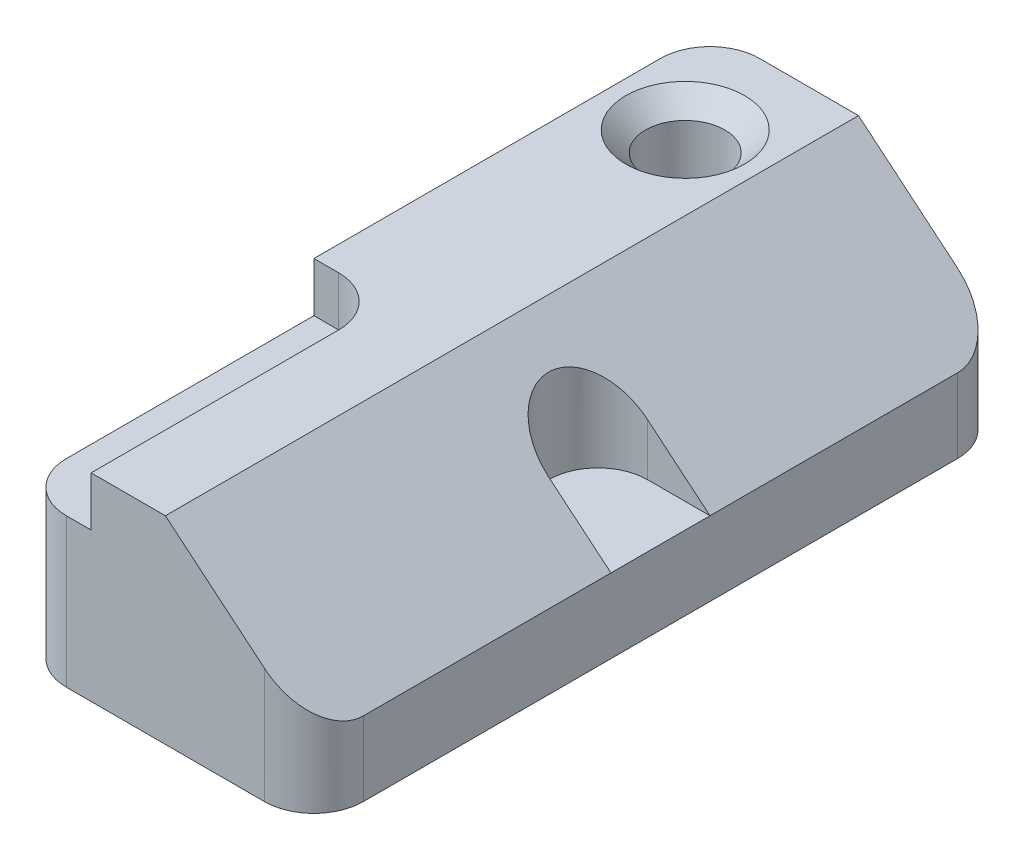
ISO-10303-21;
HEADER;
FILE_DESCRIPTION(('STEP AP214'),'2;1');
FILE_NAME('part.step','',(''),(''),'','','');
FILE_SCHEMA(('AUTOMOTIVE_DESIGN { 1 0 10303 214 1 1 1 1 }'));
ENDSEC;
DATA;
#1=APPLICATION_CONTEXT('core data for automotive mechanical design processes');
#2=APPLICATION_PROTOCOL_DEFINITION('international standard','automotive_design',2000,#1);
#3=PRODUCT_CONTEXT('',#1,'mechanical');
#4=PRODUCT('Part','Part','',(#3));
#5=PRODUCT_RELATED_PRODUCT_CATEGORY('part','',(#4));
#6=PRODUCT_DEFINITION_FORMATION('','',#4);
#7=PRODUCT_DEFINITION_CONTEXT('part definition',#1,'design');
#8=PRODUCT_DEFINITION('design','',#6,#7);
#9=PRODUCT_DEFINITION_SHAPE('','',#8);
#10=(LENGTH_UNIT() NAMED_UNIT(*) SI_UNIT(.MILLI.,.METRE.));
#11=(NAMED_UNIT(*) PLANE_ANGLE_UNIT() SI_UNIT($,.RADIAN.));
#12=(NAMED_UNIT(*) SI_UNIT($,.STERADIAN.) SOLID_ANGLE_UNIT());
#13=UNCERTAINTY_MEASURE_WITH_UNIT(LENGTH_MEASURE(1.E-05),#10,'distance_accuracy_value','');
#14=(GEOMETRIC_REPRESENTATION_CONTEXT(3) GLOBAL_UNCERTAINTY_ASSIGNED_CONTEXT((#13)) GLOBAL_UNIT_ASSIGNED_CONTEXT((#10,
#11,#12)) REPRESENTATION_CONTEXT('',''));
#15=CARTESIAN_POINT('',(0.,0.,0.));
#16=DIRECTION('',(0.,0.,1.));
#17=DIRECTION('',(1.,0.,0.));
#18=AXIS2_PLACEMENT_3D('',#15,#16,#17);
#19=CARTESIAN_POINT('',(0.,0.,177.8));
#20=DIRECTION('',(1.,0.,0.));
#21=DIRECTION('',(0.,0.,-1.));
#22=AXIS2_PLACEMENT_3D('',#19,#20,#21);
#23=PLANE('',#22);
#24=DIRECTION('',(0.,0.,-1.));
#25=VECTOR('',#24,1.);
#26=CARTESIAN_POINT('',(0.,0.,177.8));
#27=LINE('',#26,#25);
#28=CARTESIAN_POINT('',(0.,0.,165.1));
#29=VERTEX_POINT('',#28);
#30=CARTESIAN_POINT('',(0.,0.,12.7));
#31=VERTEX_POINT('',#30);
#32=EDGE_CURVE('E184',#29,#31,#27,.T.);
#33=ORIENTED_EDGE('',*,*,#32,.F.);
#34=DIRECTION('',(0.,-1.,0.));
#35=VECTOR('',#34,1.);
#36=CARTESIAN_POINT('',(0.,0.,165.1));
#37=LINE('',#36,#35);
#38=CARTESIAN_POINT('',(0.,38.1,165.1));
#39=VERTEX_POINT('',#38);
#40=EDGE_CURVE('E219',#29,#39,#37,.F.);
#41=ORIENTED_EDGE('',*,*,#40,.T.);
#42=DIRECTION('',(0.,0.,-1.));
#43=VECTOR('',#42,1.);
#44=CARTESIAN_POINT('',(0.,38.1,177.8));
#45=LINE('',#44,#43);
#46=CARTESIAN_POINT('',(0.,38.1,101.6));
#47=VERTEX_POINT('',#46);
#48=EDGE_CURVE('E300',#39,#47,#45,.T.);
#49=ORIENTED_EDGE('',*,*,#48,.T.);
#50=DIRECTION('',(0.,1.,0.));
#51=VECTOR('',#50,1.);
#52=CARTESIAN_POINT('',(0.,38.1,101.6));
#53=LINE('',#52,#51);
#54=CARTESIAN_POINT('',(0.,50.8,101.6));
#55=VERTEX_POINT('',#54);
#56=EDGE_CURVE('E283',#47,#55,#53,.T.);
#57=ORIENTED_EDGE('',*,*,#56,.T.);
#58=DIRECTION('',(0.,0.,-1.));
#59=VECTOR('',#58,1.);
#60=CARTESIAN_POINT('',(0.,50.8,177.8));
#61=LINE('',#60,#59);
#62=CARTESIAN_POINT('',(0.,50.8,12.7));
#63=VERTEX_POINT('',#62);
#64=EDGE_CURVE('E179',#55,#63,#61,.T.);
#65=ORIENTED_EDGE('',*,*,#64,.T.);
#66=DIRECTION('',(0.,-1.,0.));
#67=VECTOR('',#66,1.);
#68=CARTESIAN_POINT('',(0.,0.,12.7));
#69=LINE('',#68,#67);
#70=EDGE_CURVE('E216',#63,#31,#69,.T.);
#71=ORIENTED_EDGE('',*,*,#70,.T.);
#72=EDGE_LOOP('',(#33,#41,#49,#57,#65,#71));
#73=FACE_BOUND('',#72,.T.);
#74=ADVANCED_FACE('F35',(#73),#23,.F.);
#75=CARTESIAN_POINT('',(0.,50.8,177.8));
#76=DIRECTION('',(0.,-1.,0.));
#77=DIRECTION('',(0.,0.,-1.));
#78=AXIS2_PLACEMENT_3D('',#75,#76,#77);
#79=PLANE('',#78);
#80=CARTESIAN_POINT('',(19.05,50.8,25.4));
#81=DIRECTION('',(0.,-1.,0.));
#82=DIRECTION('',(0.,0.,-1.));
#83=AXIS2_PLACEMENT_3D('',#80,#81,#82);
#84=CIRCLE('',#83,15.24);
#85=CARTESIAN_POINT('',(19.05,50.8,10.16));
#86=VERTEX_POINT('',#85);
#87=EDGE_CURVE('E190',#86,#86,#84,.T.);
#88=ORIENTED_EDGE('',*,*,#87,.T.);
#89=EDGE_LOOP('',(#88));
#90=FACE_BOUND('',#89,.T.);
#91=DIRECTION('',(-1.,0.,0.));
#92=VECTOR('',#91,1.);
#93=CARTESIAN_POINT('',(0.,50.8,0.));
#94=LINE('',#93,#92);
#95=CARTESIAN_POINT('',(38.1,50.8,0.));
#96=VERTEX_POINT('',#95);
#97=CARTESIAN_POINT('',(12.7,50.8,0.));
#98=VERTEX_POINT('',#97);
#99=EDGE_CURVE('E245',#96,#98,#94,.T.);
#100=ORIENTED_EDGE('',*,*,#99,.T.);
#101=CARTESIAN_POINT('',(12.7,50.8,12.7));
#102=DIRECTION('',(0.,-1.,0.));
#103=DIRECTION('',(0.,0.,-1.));
#104=AXIS2_PLACEMENT_3D('',#101,#102,#103);
#105=CIRCLE('',#104,12.7);
#106=EDGE_CURVE('E227',#98,#63,#105,.F.);
#107=ORIENTED_EDGE('',*,*,#106,.T.);
#108=ORIENTED_EDGE('',*,*,#64,.F.);
#109=DIRECTION('',(1.,0.,0.));
#110=VECTOR('',#109,1.);
#111=CARTESIAN_POINT('',(0.,50.8,101.6));
#112=LINE('',#111,#110);
#113=CARTESIAN_POINT('',(6.35,50.8,101.6));
#114=VERTEX_POINT('',#113);
#115=EDGE_CURVE('E306',#55,#114,#112,.T.);
#116=ORIENTED_EDGE('',*,*,#115,.T.);
#117=CARTESIAN_POINT('',(6.35,50.8,114.3));
#118=DIRECTION('',(0.,-1.,0.));
#119=DIRECTION('',(0.,0.,-1.));
#120=AXIS2_PLACEMENT_3D('',#117,#118,#119);
#121=CIRCLE('',#120,12.7);
#122=CARTESIAN_POINT('',(19.05,50.8,114.3));
#123=VERTEX_POINT('',#122);
#124=EDGE_CURVE('E200',#114,#123,#121,.T.);
#125=ORIENTED_EDGE('',*,*,#124,.T.);
#126=DIRECTION('',(0.,0.,-1.));
#127=VECTOR('',#126,1.);
#128=CARTESIAN_POINT('',(19.05,50.8,177.8));
#129=LINE('',#128,#127);
#130=CARTESIAN_POINT('',(19.05,50.8,177.8));
#131=VERTEX_POINT('',#130);
#132=EDGE_CURVE('E303',#131,#123,#129,.T.);
#133=ORIENTED_EDGE('',*,*,#132,.F.);
#134=DIRECTION('',(-1.,0.,0.));
#135=VECTOR('',#134,1.);
#136=CARTESIAN_POINT('',(0.,50.8,177.8));
#137=LINE('',#136,#135);
#138=CARTESIAN_POINT('',(38.1,50.8,177.8));
#139=VERTEX_POINT('',#138);
#140=EDGE_CURVE('E267',#139,#131,#137,.T.);
#141=ORIENTED_EDGE('',*,*,#140,.F.);
#142=DIRECTION('',(0.,0.,-1.));
#143=VECTOR('',#142,1.);
#144=CARTESIAN_POINT('',(38.1,50.8,177.8));
#145=LINE('',#144,#143);
#146=EDGE_CURVE('E175',#139,#96,#145,.T.);
#147=ORIENTED_EDGE('',*,*,#146,.T.);
#148=EDGE_LOOP('',(#100,#107,#108,#116,#125,#133,#141,#147));
#149=FACE_BOUND('',#148,.T.);
#150=ADVANCED_FACE('F290',(#90,#149),#79,.F.);
#151=CARTESIAN_POINT('',(0.,0.,177.8));
#152=DIRECTION('',(0.,1.,0.));
#153=DIRECTION('',(0.,0.,1.));
#154=AXIS2_PLACEMENT_3D('',#151,#152,#153);
#155=PLANE('',#154);
#156=CARTESIAN_POINT('',(19.05,0.,25.4));
#157=DIRECTION('',(0.,1.,0.));
#158=DIRECTION('',(0.,0.,1.));
#159=AXIS2_PLACEMENT_3D('',#156,#157,#158);
#160=CIRCLE('',#159,10.16);
#161=CARTESIAN_POINT('',(19.05,0.,35.56));
#162=VERTEX_POINT('',#161);
#163=EDGE_CURVE('E271',#162,#162,#160,.T.);
#164=ORIENTED_EDGE('',*,*,#163,.T.);
#165=EDGE_LOOP('',(#164));
#166=FACE_BOUND('',#165,.T.);
#167=DIRECTION('',(1.,0.,0.));
#168=VECTOR('',#167,1.);
#169=CARTESIAN_POINT('',(0.,0.,177.8));
#170=LINE('',#169,#168);
#171=CARTESIAN_POINT('',(12.7,0.,177.8));
#172=VERTEX_POINT('',#171);
#173=CARTESIAN_POINT('',(63.5,0.,177.8));
#174=VERTEX_POINT('',#173);
#175=EDGE_CURVE('E259',#172,#174,#170,.T.);
#176=ORIENTED_EDGE('',*,*,#175,.F.);
#177=CARTESIAN_POINT('',(12.7,0.,165.1));
#178=DIRECTION('',(0.,1.,0.));
#179=DIRECTION('',(0.,0.,1.));
#180=AXIS2_PLACEMENT_3D('',#177,#178,#179);
#181=CIRCLE('',#180,12.7);
#182=EDGE_CURVE('E214',#172,#29,#181,.F.);
#183=ORIENTED_EDGE('',*,*,#182,.T.);
#184=ORIENTED_EDGE('',*,*,#32,.T.);
#185=CARTESIAN_POINT('',(12.7,0.,12.7));
#186=DIRECTION('',(0.,1.,0.));
#187=DIRECTION('',(0.,0.,1.));
#188=AXIS2_PLACEMENT_3D('',#185,#186,#187);
#189=CIRCLE('',#188,12.7);
#190=CARTESIAN_POINT('',(12.7,0.,0.));
#191=VERTEX_POINT('',#190);
#192=EDGE_CURVE('E212',#31,#191,#189,.F.);
#193=ORIENTED_EDGE('',*,*,#192,.T.);
#194=DIRECTION('',(1.,0.,0.));
#195=VECTOR('',#194,1.);
#196=CARTESIAN_POINT('',(0.,0.,0.));
#197=LINE('',#196,#195);
#198=CARTESIAN_POINT('',(63.5,0.,0.));
#199=VERTEX_POINT('',#198);
#200=EDGE_CURVE('E246',#191,#199,#197,.T.);
#201=ORIENTED_EDGE('',*,*,#200,.T.);
#202=CARTESIAN_POINT('',(63.5,0.,12.7));
#203=DIRECTION('',(0.,1.,0.));
#204=DIRECTION('',(0.,0.,1.));
#205=AXIS2_PLACEMENT_3D('',#202,#203,#204);
#206=CIRCLE('',#205,12.7);
#207=CARTESIAN_POINT('',(76.2,0.,12.7));
#208=VERTEX_POINT('',#207);
#209=EDGE_CURVE('E210',#199,#208,#206,.F.);
#210=ORIENTED_EDGE('',*,*,#209,.T.);
#211=DIRECTION('',(0.,0.,-1.));
#212=VECTOR('',#211,1.);
#213=CARTESIAN_POINT('',(76.2,0.,177.8));
#214=LINE('',#213,#212);
#215=CARTESIAN_POINT('',(76.2,0.,165.1));
#216=VERTEX_POINT('',#215);
#217=EDGE_CURVE('E177',#216,#208,#214,.T.);
#218=ORIENTED_EDGE('',*,*,#217,.F.);
#219=CARTESIAN_POINT('',(63.5,0.,165.1));
#220=DIRECTION('',(0.,1.,0.));
#221=DIRECTION('',(0.,0.,1.));
#222=AXIS2_PLACEMENT_3D('',#219,#220,#221);
#223=CIRCLE('',#222,12.7);
#224=EDGE_CURVE('E208',#216,#174,#223,.F.);
#225=ORIENTED_EDGE('',*,*,#224,.T.);
#226=EDGE_LOOP('',(#176,#183,#184,#193,#201,#210,#218,#225));
#227=FACE_BOUND('',#226,.T.);
#228=ADVANCED_FACE('F253',(#166,#227),#155,.F.);
#229=CARTESIAN_POINT('',(76.2,0.,177.8));
#230=DIRECTION('',(-1.,0.,0.));
#231=DIRECTION('',(0.,0.,1.));
#232=AXIS2_PLACEMENT_3D('',#229,#230,#231);
#233=PLANE('',#232);
#234=ORIENTED_EDGE('',*,*,#217,.T.);
#235=DIRECTION('',(0.,1.,0.));
#236=VECTOR('',#235,1.);
#237=CARTESIAN_POINT('',(76.2,19.05,12.7));
#238=LINE('',#237,#236);
#239=CARTESIAN_POINT('',(76.2,19.05,12.7));
#240=VERTEX_POINT('',#239);
#241=EDGE_CURVE('E173',#208,#240,#238,.T.);
#242=ORIENTED_EDGE('',*,*,#241,.T.);
#243=DIRECTION('',(0.,0.,-1.));
#244=VECTOR('',#243,1.);
#245=CARTESIAN_POINT('',(76.2,19.05,177.8));
#246=LINE('',#245,#244);
#247=CARTESIAN_POINT('',(76.2,19.05,76.2));
#248=VERTEX_POINT('',#247);
#249=EDGE_CURVE('E58',#248,#240,#246,.T.);
#250=ORIENTED_EDGE('',*,*,#249,.F.);
#251=DIRECTION('',(0.,0.,-1.));
#252=VECTOR('',#251,1.);
#253=CARTESIAN_POINT('',(76.2,19.05,101.6));
#254=LINE('',#253,#252);
#255=CARTESIAN_POINT('',(76.2,19.05,101.6));
#256=VERTEX_POINT('',#255);
#257=EDGE_CURVE('E157',#256,#248,#254,.T.);
#258=ORIENTED_EDGE('',*,*,#257,.F.);
#259=CARTESIAN_POINT('',(76.2,19.05,165.1));
#260=VERTEX_POINT('',#259);
#261=EDGE_CURVE('E174',#260,#256,#246,.T.);
#262=ORIENTED_EDGE('',*,*,#261,.F.);
#263=DIRECTION('',(0.,1.,0.));
#264=VECTOR('',#263,1.);
#265=CARTESIAN_POINT('',(76.2,0.,165.1));
#266=LINE('',#265,#264);
#267=EDGE_CURVE('E229',#260,#216,#266,.F.);
#268=ORIENTED_EDGE('',*,*,#267,.T.);
#269=EDGE_LOOP('',(#234,#242,#250,#258,#262,#268));
#270=FACE_BOUND('',#269,.T.);
#271=ADVANCED_FACE('F171',(#270),#233,.F.);
#272=CARTESIAN_POINT('',(38.1,50.8,177.8));
#273=DIRECTION('',(-0.64018439966448,-0.768221279597376,0.));
#274=DIRECTION('',(0.768221279597376,-0.64018439966448,0.));
#275=AXIS2_PLACEMENT_3D('',#272,#273,#274);
#276=PLANE('',#275);
#277=ORIENTED_EDGE('',*,*,#261,.T.);
#278=DIRECTION('',(-0.768221279597376,0.64018439966448,0.));
#279=VECTOR('',#278,1.);
#280=CARTESIAN_POINT('',(38.1,50.8,101.6));
#281=LINE('',#280,#279);
#282=CARTESIAN_POINT('',(60.198,32.385,101.6));
#283=VERTEX_POINT('',#282);
#284=EDGE_CURVE('E11',#256,#283,#281,.T.);
#285=ORIENTED_EDGE('',*,*,#284,.T.);
#286=CARTESIAN_POINT('',(60.198,32.385,88.9));
#287=DIRECTION('',(-0.64018439966448,-0.768221279597376,0.));
#288=DIRECTION('',(-0.768221279597376,0.64018439966448,0.));
#289=AXIS2_PLACEMENT_3D('',#286,#287,#288);
#290=ELLIPSE('',#289,16.5316951473358,12.7);
#291=CARTESIAN_POINT('',(60.198,32.385,76.2));
#292=VERTEX_POINT('',#291);
#293=EDGE_CURVE('E43',#283,#292,#290,.T.);
#294=ORIENTED_EDGE('',*,*,#293,.T.);
#295=DIRECTION('',(0.768221279597376,-0.64018439966448,0.));
#296=VECTOR('',#295,1.);
#297=CARTESIAN_POINT('',(38.1000000000001,50.8,76.2));
#298=LINE('',#297,#296);
#299=EDGE_CURVE('E152',#292,#248,#298,.T.);
#300=ORIENTED_EDGE('',*,*,#299,.T.);
#301=ORIENTED_EDGE('',*,*,#249,.T.);
#302=CARTESIAN_POINT('',(63.5,29.6333333333333,12.7));
#303=DIRECTION('',(-0.64018439966448,-0.768221279597376,0.));
#304=DIRECTION('',(0.768221279597376,-0.64018439966448,0.));
#305=AXIS2_PLACEMENT_3D('',#302,#303,#304);
#306=ELLIPSE('',#305,16.5316951473358,12.7);
#307=CARTESIAN_POINT('',(63.5,29.6333333333333,0.));
#308=VERTEX_POINT('',#307);
#309=EDGE_CURVE('E167',#240,#308,#306,.F.);
#310=ORIENTED_EDGE('',*,*,#309,.T.);
#311=DIRECTION('',(-0.768221279597376,0.64018439966448,0.));
#312=VECTOR('',#311,1.);
#313=CARTESIAN_POINT('',(38.1,50.8,0.));
#314=LINE('',#313,#312);
#315=EDGE_CURVE('E236',#308,#96,#314,.T.);
#316=ORIENTED_EDGE('',*,*,#315,.T.);
#317=ORIENTED_EDGE('',*,*,#146,.F.);
#318=DIRECTION('',(-0.768221279597376,0.64018439966448,0.));
#319=VECTOR('',#318,1.);
#320=CARTESIAN_POINT('',(38.1,50.8,177.8));
#321=LINE('',#320,#319);
#322=CARTESIAN_POINT('',(63.5,29.6333333333333,177.8));
#323=VERTEX_POINT('',#322);
#324=EDGE_CURVE('E265',#323,#139,#321,.T.);
#325=ORIENTED_EDGE('',*,*,#324,.F.);
#326=CARTESIAN_POINT('',(63.5,29.6333333333333,165.1));
#327=DIRECTION('',(-0.64018439966448,-0.768221279597376,0.));
#328=DIRECTION('',(-0.768221279597376,0.64018439966448,0.));
#329=AXIS2_PLACEMENT_3D('',#326,#327,#328);
#330=ELLIPSE('',#329,16.5316951473358,12.7);
#331=EDGE_CURVE('E232',#323,#260,#330,.F.);
#332=ORIENTED_EDGE('',*,*,#331,.T.);
#333=EDGE_LOOP('',(#277,#285,#294,#300,#301,#310,#316,#317,#325,#332));
#334=FACE_BOUND('',#333,.T.);
#335=ADVANCED_FACE('F166',(#334),#276,.F.);
#336=CARTESIAN_POINT('',(0.,0.,177.8));
#337=DIRECTION('',(0.,0.,-1.));
#338=DIRECTION('',(-1.,0.,0.));
#339=AXIS2_PLACEMENT_3D('',#336,#337,#338);
#340=PLANE('',#339);
#341=DIRECTION('',(1.,0.,0.));
#342=VECTOR('',#341,1.);
#343=CARTESIAN_POINT('',(0.,38.1,177.8));
#344=LINE('',#343,#342);
#345=CARTESIAN_POINT('',(12.7,38.1,177.8));
#346=VERTEX_POINT('',#345);
#347=CARTESIAN_POINT('',(19.05,38.1,177.8));
#348=VERTEX_POINT('',#347);
#349=EDGE_CURVE('E295',#346,#348,#344,.T.);
#350=ORIENTED_EDGE('',*,*,#349,.F.);
#351=DIRECTION('',(0.,-1.,0.));
#352=VECTOR('',#351,1.);
#353=CARTESIAN_POINT('',(12.7,0.,177.8));
#354=LINE('',#353,#352);
#355=EDGE_CURVE('E205',#346,#172,#354,.T.);
#356=ORIENTED_EDGE('',*,*,#355,.T.);
#357=ORIENTED_EDGE('',*,*,#175,.T.);
#358=DIRECTION('',(0.,1.,0.));
#359=VECTOR('',#358,1.);
#360=CARTESIAN_POINT('',(63.5,0.,177.8));
#361=LINE('',#360,#359);
#362=EDGE_CURVE('E202',#174,#323,#361,.T.);
#363=ORIENTED_EDGE('',*,*,#362,.T.);
#364=ORIENTED_EDGE('',*,*,#324,.T.);
#365=ORIENTED_EDGE('',*,*,#140,.T.);
#366=DIRECTION('',(0.,1.,0.));
#367=VECTOR('',#366,1.);
#368=CARTESIAN_POINT('',(19.05,38.1,177.8));
#369=LINE('',#368,#367);
#370=EDGE_CURVE('E294',#348,#131,#369,.T.);
#371=ORIENTED_EDGE('',*,*,#370,.F.);
#372=EDGE_LOOP('',(#350,#356,#357,#363,#364,#365,#371));
#373=FACE_BOUND('',#372,.T.);
#374=ADVANCED_FACE('F262',(#373),#340,.F.);
#375=CARTESIAN_POINT('',(0.,0.,0.));
#376=DIRECTION('',(0.,0.,-1.));
#377=DIRECTION('',(-1.,0.,0.));
#378=AXIS2_PLACEMENT_3D('',#375,#376,#377);
#379=PLANE('',#378);
#380=ORIENTED_EDGE('',*,*,#200,.F.);
#381=DIRECTION('',(0.,-1.,0.));
#382=VECTOR('',#381,1.);
#383=CARTESIAN_POINT('',(12.7,50.8,0.));
#384=LINE('',#383,#382);
#385=EDGE_CURVE('E225',#191,#98,#384,.F.);
#386=ORIENTED_EDGE('',*,*,#385,.T.);
#387=ORIENTED_EDGE('',*,*,#99,.F.);
#388=ORIENTED_EDGE('',*,*,#315,.F.);
#389=DIRECTION('',(0.,1.,0.));
#390=VECTOR('',#389,1.);
#391=CARTESIAN_POINT('',(63.5,0.,0.));
#392=LINE('',#391,#390);
#393=EDGE_CURVE('E223',#308,#199,#392,.F.);
#394=ORIENTED_EDGE('',*,*,#393,.T.);
#395=EDGE_LOOP('',(#380,#386,#387,#388,#394));
#396=FACE_BOUND('',#395,.T.);
#397=ADVANCED_FACE('F242',(#396),#379,.T.);
#398=CARTESIAN_POINT('',(19.05,0.,25.4));
#399=DIRECTION('',(0.,1.,0.));
#400=DIRECTION('',(0.,0.,1.));
#401=AXIS2_PLACEMENT_3D('',#398,#399,#400);
#402=CYLINDRICAL_SURFACE('',#401,10.16);
#403=CARTESIAN_POINT('',(19.05,45.7200000000001,25.4));
#404=DIRECTION('',(0.,-1.,0.));
#405=DIRECTION('',(0.,0.,-1.));
#406=AXIS2_PLACEMENT_3D('',#403,#404,#405);
#407=CIRCLE('',#406,10.16);
#408=CARTESIAN_POINT('',(19.05,45.7200000000001,15.24));
#409=VERTEX_POINT('',#408);
#410=EDGE_CURVE('E187',#409,#409,#407,.F.);
#411=ORIENTED_EDGE('',*,*,#410,.T.);
#412=EDGE_LOOP('',(#411));
#413=FACE_BOUND('',#412,.T.);
#414=ORIENTED_EDGE('',*,*,#163,.F.);
#415=EDGE_LOOP('',(#414));
#416=FACE_BOUND('',#415,.T.);
#417=ADVANCED_FACE('F349',(#413,#416),#402,.F.);
#418=CARTESIAN_POINT('',(19.05,45.7200000000001,25.4));
#419=DIRECTION('',(0.,1.,0.));
#420=DIRECTION('',(0.,0.,1.));
#421=AXIS2_PLACEMENT_3D('',#418,#419,#420);
#422=CONICAL_SURFACE('',#421,10.16,0.785398163397452);
#423=ORIENTED_EDGE('',*,*,#87,.F.);
#424=EDGE_LOOP('',(#423));
#425=FACE_BOUND('',#424,.T.);
#426=ORIENTED_EDGE('',*,*,#410,.F.);
#427=EDGE_LOOP('',(#426));
#428=FACE_BOUND('',#427,.T.);
#429=ADVANCED_FACE('F343',(#425,#428),#422,.F.);
#430=CARTESIAN_POINT('',(0.,38.1,101.6));
#431=DIRECTION('',(0.,0.,1.));
#432=DIRECTION('',(1.,0.,0.));
#433=AXIS2_PLACEMENT_3D('',#430,#431,#432);
#434=PLANE('',#433);
#435=DIRECTION('',(1.,0.,0.));
#436=VECTOR('',#435,1.);
#437=CARTESIAN_POINT('',(0.,38.1,101.6));
#438=LINE('',#437,#436);
#439=CARTESIAN_POINT('',(6.35,38.1,101.6));
#440=VERTEX_POINT('',#439);
#441=EDGE_CURVE('E305',#47,#440,#438,.T.);
#442=ORIENTED_EDGE('',*,*,#441,.T.);
#443=DIRECTION('',(0.,1.,0.));
#444=VECTOR('',#443,1.);
#445=CARTESIAN_POINT('',(6.35,38.1,101.6));
#446=LINE('',#445,#444);
#447=EDGE_CURVE('E193',#440,#114,#446,.T.);
#448=ORIENTED_EDGE('',*,*,#447,.T.);
#449=ORIENTED_EDGE('',*,*,#115,.F.);
#450=ORIENTED_EDGE('',*,*,#56,.F.);
#451=EDGE_LOOP('',(#442,#448,#449,#450));
#452=FACE_BOUND('',#451,.T.);
#453=ADVANCED_FACE('F348',(#452),#434,.T.);
#454=CARTESIAN_POINT('',(19.05,38.1,177.8));
#455=DIRECTION('',(1.,0.,0.));
#456=DIRECTION('',(0.,0.,-1.));
#457=AXIS2_PLACEMENT_3D('',#454,#455,#456);
#458=PLANE('',#457);
#459=ORIENTED_EDGE('',*,*,#132,.T.);
#460=DIRECTION('',(0.,1.,0.));
#461=VECTOR('',#460,1.);
#462=CARTESIAN_POINT('',(19.05,38.1,114.3));
#463=LINE('',#462,#461);
#464=CARTESIAN_POINT('',(19.05,38.1,114.3));
#465=VERTEX_POINT('',#464);
#466=EDGE_CURVE('E196',#123,#465,#463,.F.);
#467=ORIENTED_EDGE('',*,*,#466,.T.);
#468=DIRECTION('',(0.,0.,-1.));
#469=VECTOR('',#468,1.);
#470=CARTESIAN_POINT('',(19.05,38.1,177.8));
#471=LINE('',#470,#469);
#472=EDGE_CURVE('E311',#348,#465,#471,.T.);
#473=ORIENTED_EDGE('',*,*,#472,.F.);
#474=ORIENTED_EDGE('',*,*,#370,.T.);
#475=EDGE_LOOP('',(#459,#467,#473,#474));
#476=FACE_BOUND('',#475,.T.);
#477=ADVANCED_FACE('F436',(#476),#458,.F.);
#478=CARTESIAN_POINT('',(0.,38.1,0.));
#479=DIRECTION('',(0.,1.,0.));
#480=DIRECTION('',(0.,0.,1.));
#481=AXIS2_PLACEMENT_3D('',#478,#479,#480);
#482=PLANE('',#481);
#483=ORIENTED_EDGE('',*,*,#48,.F.);
#484=CARTESIAN_POINT('',(12.7,38.1,165.1));
#485=DIRECTION('',(0.,1.,0.));
#486=DIRECTION('',(0.,0.,1.));
#487=AXIS2_PLACEMENT_3D('',#484,#485,#486);
#488=CIRCLE('',#487,12.7);
#489=EDGE_CURVE('E221',#39,#346,#488,.T.);
#490=ORIENTED_EDGE('',*,*,#489,.T.);
#491=ORIENTED_EDGE('',*,*,#349,.T.);
#492=ORIENTED_EDGE('',*,*,#472,.T.);
#493=CARTESIAN_POINT('',(6.35,38.1,114.3));
#494=DIRECTION('',(0.,1.,0.));
#495=DIRECTION('',(0.,0.,1.));
#496=AXIS2_PLACEMENT_3D('',#493,#494,#495);
#497=CIRCLE('',#496,12.7);
#498=EDGE_CURVE('E198',#465,#440,#497,.T.);
#499=ORIENTED_EDGE('',*,*,#498,.T.);
#500=ORIENTED_EDGE('',*,*,#441,.F.);
#501=EDGE_LOOP('',(#483,#490,#491,#492,#499,#500));
#502=FACE_BOUND('',#501,.T.);
#503=ADVANCED_FACE('F355',(#502),#482,.T.);
#504=CARTESIAN_POINT('',(6.35,38.1,114.3));
#505=DIRECTION('',(0.,1.,0.));
#506=DIRECTION('',(0.,0.,1.));
#507=AXIS2_PLACEMENT_3D('',#504,#505,#506);
#508=CYLINDRICAL_SURFACE('',#507,12.7);
#509=ORIENTED_EDGE('',*,*,#498,.F.);
#510=ORIENTED_EDGE('',*,*,#466,.F.);
#511=ORIENTED_EDGE('',*,*,#124,.F.);
#512=ORIENTED_EDGE('',*,*,#447,.F.);
#513=EDGE_LOOP('',(#509,#510,#511,#512));
#514=FACE_BOUND('',#513,.T.);
#515=ADVANCED_FACE('F351',(#514),#508,.F.);
#516=CARTESIAN_POINT('',(12.7,0.,165.1));
#517=DIRECTION('',(0.,-1.,0.));
#518=DIRECTION('',(0.,0.,-1.));
#519=AXIS2_PLACEMENT_3D('',#516,#517,#518);
#520=CYLINDRICAL_SURFACE('',#519,12.7);
#521=ORIENTED_EDGE('',*,*,#489,.F.);
#522=ORIENTED_EDGE('',*,*,#40,.F.);
#523=ORIENTED_EDGE('',*,*,#182,.F.);
#524=ORIENTED_EDGE('',*,*,#355,.F.);
#525=EDGE_LOOP('',(#521,#522,#523,#524));
#526=FACE_BOUND('',#525,.T.);
#527=ADVANCED_FACE('F354',(#526),#520,.T.);
#528=CARTESIAN_POINT('',(12.7,0.,12.7));
#529=DIRECTION('',(0.,1.,0.));
#530=DIRECTION('',(0.,0.,1.));
#531=AXIS2_PLACEMENT_3D('',#528,#529,#530);
#532=CYLINDRICAL_SURFACE('',#531,12.7);
#533=ORIENTED_EDGE('',*,*,#106,.F.);
#534=ORIENTED_EDGE('',*,*,#385,.F.);
#535=ORIENTED_EDGE('',*,*,#192,.F.);
#536=ORIENTED_EDGE('',*,*,#70,.F.);
#537=EDGE_LOOP('',(#533,#534,#535,#536));
#538=FACE_BOUND('',#537,.T.);
#539=ADVANCED_FACE('F288',(#538),#532,.T.);
#540=CARTESIAN_POINT('',(63.5,0.,12.7));
#541=DIRECTION('',(0.,-1.,0.));
#542=DIRECTION('',(0.,0.,-1.));
#543=AXIS2_PLACEMENT_3D('',#540,#541,#542);
#544=CYLINDRICAL_SURFACE('',#543,12.7);
#545=ORIENTED_EDGE('',*,*,#209,.F.);
#546=ORIENTED_EDGE('',*,*,#393,.F.);
#547=ORIENTED_EDGE('',*,*,#309,.F.);
#548=ORIENTED_EDGE('',*,*,#241,.F.);
#549=EDGE_LOOP('',(#545,#546,#547,#548));
#550=FACE_BOUND('',#549,.T.);
#551=ADVANCED_FACE('F249',(#550),#544,.T.);
#552=CARTESIAN_POINT('',(63.5,0.,165.1));
#553=DIRECTION('',(0.,1.,0.));
#554=DIRECTION('',(0.,0.,1.));
#555=AXIS2_PLACEMENT_3D('',#552,#553,#554);
#556=CYLINDRICAL_SURFACE('',#555,12.7);
#557=ORIENTED_EDGE('',*,*,#224,.F.);
#558=ORIENTED_EDGE('',*,*,#267,.F.);
#559=ORIENTED_EDGE('',*,*,#331,.F.);
#560=ORIENTED_EDGE('',*,*,#362,.F.);
#561=EDGE_LOOP('',(#557,#558,#559,#560));
#562=FACE_BOUND('',#561,.T.);
#563=ADVANCED_FACE('F37',(#562),#556,.T.);
#564=CARTESIAN_POINT('',(60.198,19.05,101.6));
#565=DIRECTION('',(0.,0.,1.));
#566=DIRECTION('',(1.,0.,0.));
#567=AXIS2_PLACEMENT_3D('',#564,#565,#566);
#568=PLANE('',#567);
#569=DIRECTION('',(1.,0.,0.));
#570=VECTOR('',#569,1.);
#571=CARTESIAN_POINT('',(60.198,19.05,101.6));
#572=LINE('',#571,#570);
#573=CARTESIAN_POINT('',(60.198,19.05,101.6));
#574=VERTEX_POINT('',#573);
#575=EDGE_CURVE('E50',#574,#256,#572,.T.);
#576=ORIENTED_EDGE('',*,*,#575,.F.);
#577=DIRECTION('',(0.,1.,0.));
#578=VECTOR('',#577,1.);
#579=CARTESIAN_POINT('',(60.198,19.05,101.6));
#580=LINE('',#579,#578);
#581=EDGE_CURVE('E308',#574,#283,#580,.T.);
#582=ORIENTED_EDGE('',*,*,#581,.T.);
#583=ORIENTED_EDGE('',*,*,#284,.F.);
#584=EDGE_LOOP('',(#576,#582,#583));
#585=FACE_BOUND('',#584,.T.);
#586=ADVANCED_FACE('F322',(#585),#568,.F.);
#587=CARTESIAN_POINT('',(60.198,19.05,88.9));
#588=DIRECTION('',(0.,1.,0.));
#589=DIRECTION('',(0.,0.,1.));
#590=AXIS2_PLACEMENT_3D('',#587,#588,#589);
#591=CYLINDRICAL_SURFACE('',#590,12.7);
#592=ORIENTED_EDGE('',*,*,#581,.F.);
#593=CARTESIAN_POINT('',(60.198,19.05,88.9));
#594=DIRECTION('',(0.,1.,0.));
#595=DIRECTION('',(0.,0.,1.));
#596=AXIS2_PLACEMENT_3D('',#593,#594,#595);
#597=CIRCLE('',#596,12.7);
#598=CARTESIAN_POINT('',(60.198,19.05,76.2));
#599=VERTEX_POINT('',#598);
#600=EDGE_CURVE('E156',#599,#574,#597,.T.);
#601=ORIENTED_EDGE('',*,*,#600,.F.);
#602=DIRECTION('',(0.,1.,0.));
#603=VECTOR('',#602,1.);
#604=CARTESIAN_POINT('',(60.198,19.05,76.2));
#605=LINE('',#604,#603);
#606=EDGE_CURVE('E154',#599,#292,#605,.T.);
#607=ORIENTED_EDGE('',*,*,#606,.T.);
#608=ORIENTED_EDGE('',*,*,#293,.F.);
#609=EDGE_LOOP('',(#592,#601,#607,#608));
#610=FACE_BOUND('',#609,.T.);
#611=ADVANCED_FACE('F323',(#610),#591,.F.);
#612=CARTESIAN_POINT('',(76.2,19.05,76.2));
#613=DIRECTION('',(0.,0.,-1.));
#614=DIRECTION('',(-1.,0.,0.));
#615=AXIS2_PLACEMENT_3D('',#612,#613,#614);
#616=PLANE('',#615);
#617=ORIENTED_EDGE('',*,*,#606,.F.);
#618=DIRECTION('',(-1.,0.,0.));
#619=VECTOR('',#618,1.);
#620=CARTESIAN_POINT('',(76.2,19.05,76.2));
#621=LINE('',#620,#619);
#622=EDGE_CURVE('E150',#248,#599,#621,.T.);
#623=ORIENTED_EDGE('',*,*,#622,.F.);
#624=ORIENTED_EDGE('',*,*,#299,.F.);
#625=EDGE_LOOP('',(#617,#623,#624));
#626=FACE_BOUND('',#625,.T.);
#627=ADVANCED_FACE('F151',(#626),#616,.F.);
#628=CARTESIAN_POINT('',(60.198,19.05,88.9));
#629=DIRECTION('',(0.,1.,0.));
#630=DIRECTION('',(0.,0.,1.));
#631=AXIS2_PLACEMENT_3D('',#628,#629,#630);
#632=PLANE('',#631);
#633=ORIENTED_EDGE('',*,*,#257,.T.);
#634=ORIENTED_EDGE('',*,*,#622,.T.);
#635=ORIENTED_EDGE('',*,*,#600,.T.);
#636=ORIENTED_EDGE('',*,*,#575,.T.);
#637=EDGE_LOOP('',(#633,#634,#635,#636));
#638=FACE_BOUND('',#637,.T.);
#639=ADVANCED_FACE('F160',(#638),#632,.T.);
#640=CLOSED_SHELL('',(#74,#150,#228,#271,#335,#374,#397,#417,#429,#453,#477,#503,#515,#527,#539,
#551,#563,#586,#611,#627,#639));
#641=MANIFOLD_SOLID_BREP('B2',#640);
#642=ADVANCED_BREP_SHAPE_REPRESENTATION('',(#18,#641),#14);
#643=SHAPE_DEFINITION_REPRESENTATION(#9,#642);
ENDSEC;
END-ISO-10303-21;
